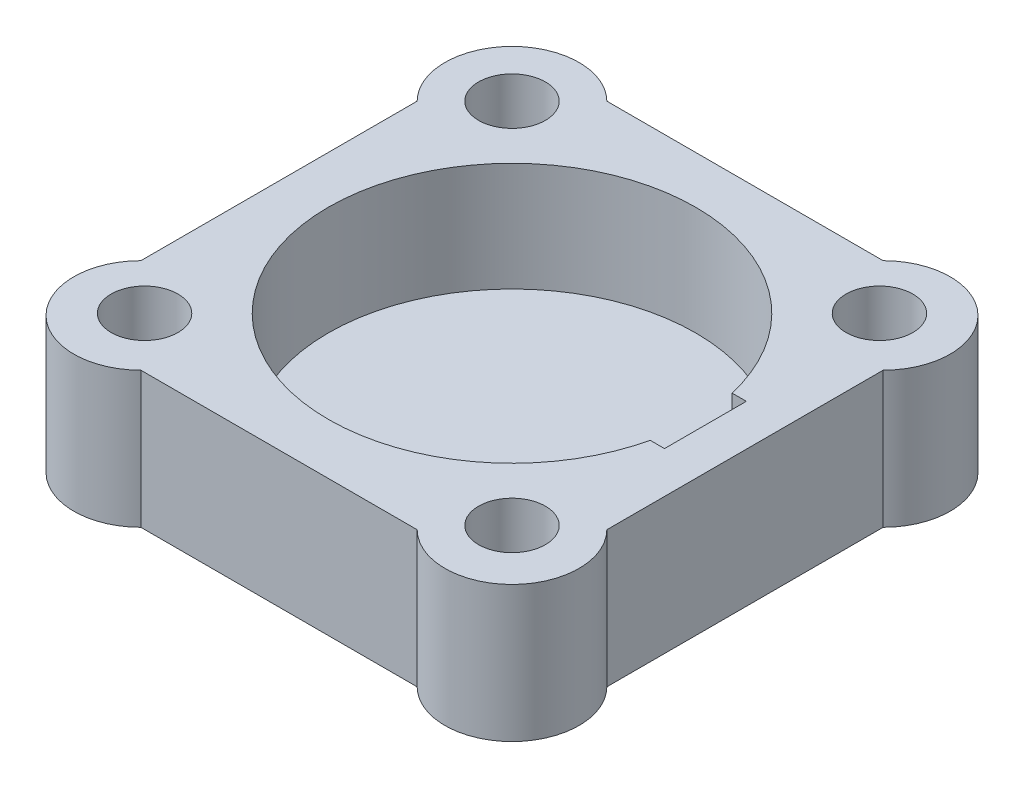
ISO-10303-21;
HEADER;
FILE_DESCRIPTION(('STEP AP214'),'2;1');
FILE_NAME('part.step','',(''),(''),'','','');
FILE_SCHEMA(('AUTOMOTIVE_DESIGN { 1 0 10303 214 1 1 1 1 }'));
ENDSEC;
DATA;
#1=APPLICATION_CONTEXT('core data for automotive mechanical design processes');
#2=APPLICATION_PROTOCOL_DEFINITION('international standard','automotive_design',2000,#1);
#3=PRODUCT_CONTEXT('',#1,'mechanical');
#4=PRODUCT('Part','Part','',(#3));
#5=PRODUCT_RELATED_PRODUCT_CATEGORY('part','',(#4));
#6=PRODUCT_DEFINITION_FORMATION('','',#4);
#7=PRODUCT_DEFINITION_CONTEXT('part definition',#1,'design');
#8=PRODUCT_DEFINITION('design','',#6,#7);
#9=PRODUCT_DEFINITION_SHAPE('','',#8);
#10=(LENGTH_UNIT() NAMED_UNIT(*) SI_UNIT(.MILLI.,.METRE.));
#11=(NAMED_UNIT(*) PLANE_ANGLE_UNIT() SI_UNIT($,.RADIAN.));
#12=(NAMED_UNIT(*) SI_UNIT($,.STERADIAN.) SOLID_ANGLE_UNIT());
#13=UNCERTAINTY_MEASURE_WITH_UNIT(LENGTH_MEASURE(1.E-05),#10,'distance_accuracy_value','');
#14=(GEOMETRIC_REPRESENTATION_CONTEXT(3) GLOBAL_UNCERTAINTY_ASSIGNED_CONTEXT((#13)) GLOBAL_UNIT_ASSIGNED_CONTEXT((#10,
#11,#12)) REPRESENTATION_CONTEXT('',''));
#15=CARTESIAN_POINT('',(0.,0.,0.));
#16=DIRECTION('',(0.,0.,1.));
#17=DIRECTION('',(1.,0.,0.));
#18=AXIS2_PLACEMENT_3D('',#15,#16,#17);
#19=CARTESIAN_POINT('',(0.,15.,0.));
#20=DIRECTION('',(0.,-1.,0.));
#21=DIRECTION('',(0.,0.,-1.));
#22=AXIS2_PLACEMENT_3D('',#19,#20,#21);
#23=CYLINDRICAL_SURFACE('',#22,20.25);
#24=CARTESIAN_POINT('',(0.,15.,0.));
#25=DIRECTION('',(0.,1.,0.));
#26=DIRECTION('',(0.,0.,1.));
#27=AXIS2_PLACEMENT_3D('',#24,#25,#26);
#28=CIRCLE('',#27,20.25);
#29=CARTESIAN_POINT('',(19.7411817978626,15.,-4.510902484397));
#30=VERTEX_POINT('',#29);
#31=CARTESIAN_POINT('',(19.7411817978626,15.,4.510902484397));
#32=VERTEX_POINT('',#31);
#33=EDGE_CURVE('E152',#30,#32,#28,.T.);
#34=ORIENTED_EDGE('',*,*,#33,.T.);
#35=DIRECTION('',(0.,-1.,0.));
#36=VECTOR('',#35,1.);
#37=CARTESIAN_POINT('',(19.7411817978626,15.,4.510902484397));
#38=LINE('',#37,#36);
#39=CARTESIAN_POINT('',(19.7411817978626,3.,4.510902484397));
#40=VERTEX_POINT('',#39);
#41=EDGE_CURVE('E170',#32,#40,#38,.T.);
#42=ORIENTED_EDGE('',*,*,#41,.T.);
#43=CARTESIAN_POINT('',(0.,3.,0.));
#44=DIRECTION('',(0.,-1.,0.));
#45=DIRECTION('',(0.,0.,-1.));
#46=AXIS2_PLACEMENT_3D('',#43,#44,#45);
#47=CIRCLE('',#46,20.25);
#48=CARTESIAN_POINT('',(19.7411817978626,3.,-4.510902484397));
#49=VERTEX_POINT('',#48);
#50=EDGE_CURVE('E173',#40,#49,#47,.T.);
#51=ORIENTED_EDGE('',*,*,#50,.T.);
#52=DIRECTION('',(0.,-1.,0.));
#53=VECTOR('',#52,1.);
#54=CARTESIAN_POINT('',(19.7411817978626,15.,-4.510902484397));
#55=LINE('',#54,#53);
#56=EDGE_CURVE('E55',#30,#49,#55,.T.);
#57=ORIENTED_EDGE('',*,*,#56,.F.);
#58=EDGE_LOOP('',(#34,#42,#51,#57));
#59=FACE_BOUND('',#58,.T.);
#60=ADVANCED_FACE('F33',(#59),#23,.F.);
#61=CARTESIAN_POINT('',(-20.25,15.,-20.25));
#62=DIRECTION('',(0.,-1.,0.));
#63=DIRECTION('',(0.,0.,-1.));
#64=AXIS2_PLACEMENT_3D('',#61,#62,#63);
#65=PLANE('',#64);
#66=CARTESIAN_POINT('',(-20.25,15.,20.25));
#67=DIRECTION('',(0.,1.,0.));
#68=DIRECTION('',(0.,0.,1.));
#69=AXIS2_PLACEMENT_3D('',#66,#67,#68);
#70=CIRCLE('',#69,3.68222971473307);
#71=CARTESIAN_POINT('',(-20.25,15.,23.9322297147331));
#72=VERTEX_POINT('',#71);
#73=EDGE_CURVE('E177',#72,#72,#70,.T.);
#74=ORIENTED_EDGE('',*,*,#73,.F.);
#75=EDGE_LOOP('',(#74));
#76=FACE_BOUND('',#75,.T.);
#77=CARTESIAN_POINT('',(20.25,15.,20.25));
#78=DIRECTION('',(0.,1.,0.));
#79=DIRECTION('',(0.,0.,1.));
#80=AXIS2_PLACEMENT_3D('',#77,#78,#79);
#81=CIRCLE('',#80,3.68222971473307);
#82=CARTESIAN_POINT('',(20.25,15.,23.9322297147331));
#83=VERTEX_POINT('',#82);
#84=EDGE_CURVE('E183',#83,#83,#81,.T.);
#85=ORIENTED_EDGE('',*,*,#84,.F.);
#86=EDGE_LOOP('',(#85));
#87=FACE_BOUND('',#86,.T.);
#88=CARTESIAN_POINT('',(20.25,15.,-20.25));
#89=DIRECTION('',(0.,1.,0.));
#90=DIRECTION('',(0.,0.,1.));
#91=AXIS2_PLACEMENT_3D('',#88,#89,#90);
#92=CIRCLE('',#91,3.68222971473307);
#93=CARTESIAN_POINT('',(20.25,15.,-16.5677702852669));
#94=VERTEX_POINT('',#93);
#95=EDGE_CURVE('E189',#94,#94,#92,.T.);
#96=ORIENTED_EDGE('',*,*,#95,.F.);
#97=EDGE_LOOP('',(#96));
#98=FACE_BOUND('',#97,.T.);
#99=CARTESIAN_POINT('',(-20.25,15.,-20.25));
#100=DIRECTION('',(0.,1.,0.));
#101=DIRECTION('',(0.,0.,1.));
#102=AXIS2_PLACEMENT_3D('',#99,#100,#101);
#103=CIRCLE('',#102,3.68222971473307);
#104=CARTESIAN_POINT('',(-20.25,15.,-16.5677702852669));
#105=VERTEX_POINT('',#104);
#106=EDGE_CURVE('E195',#105,#105,#103,.T.);
#107=ORIENTED_EDGE('',*,*,#106,.F.);
#108=EDGE_LOOP('',(#107));
#109=FACE_BOUND('',#108,.T.);
#110=CARTESIAN_POINT('',(-20.25,15.,-20.25));
#111=DIRECTION('',(0.,1.,0.));
#112=DIRECTION('',(0.,0.,-1.));
#113=AXIS2_PLACEMENT_3D('',#110,#111,#112);
#114=CIRCLE('',#113,7.39252400003237);
#115=CARTESIAN_POINT('',(-15.0226961494928,15.,-25.4773038505072));
#116=VERTEX_POINT('',#115);
#117=CARTESIAN_POINT('',(-25.4773038505072,15.,-15.0226961494928));
#118=VERTEX_POINT('',#117);
#119=EDGE_CURVE('E202',#116,#118,#114,.T.);
#120=ORIENTED_EDGE('',*,*,#119,.T.);
#121=DIRECTION('',(0.,0.,1.));
#122=VECTOR('',#121,1.);
#123=CARTESIAN_POINT('',(-25.4773038505072,15.,15.4331642276718));
#124=LINE('',#123,#122);
#125=CARTESIAN_POINT('',(-25.4773038505072,15.,15.4331642276718));
#126=VERTEX_POINT('',#125);
#127=EDGE_CURVE('E205',#118,#126,#124,.T.);
#128=ORIENTED_EDGE('',*,*,#127,.T.);
#129=CARTESIAN_POINT('',(-20.25,15.,20.660468078179));
#130=DIRECTION('',(0.,1.,0.));
#131=DIRECTION('',(0.,0.,-1.));
#132=AXIS2_PLACEMENT_3D('',#129,#130,#131);
#133=CIRCLE('',#132,7.39252400003237);
#134=CARTESIAN_POINT('',(-15.0226961494928,15.,25.8877719286862));
#135=VERTEX_POINT('',#134);
#136=EDGE_CURVE('E208',#126,#135,#133,.T.);
#137=ORIENTED_EDGE('',*,*,#136,.T.);
#138=DIRECTION('',(1.,0.,0.));
#139=VECTOR('',#138,1.);
#140=CARTESIAN_POINT('',(15.4331642276718,15.,25.8877719286862));
#141=LINE('',#140,#139);
#142=CARTESIAN_POINT('',(15.4331642276718,15.,25.8877719286862));
#143=VERTEX_POINT('',#142);
#144=EDGE_CURVE('E210',#135,#143,#141,.T.);
#145=ORIENTED_EDGE('',*,*,#144,.T.);
#146=CARTESIAN_POINT('',(20.660468078179,15.,20.660468078179));
#147=DIRECTION('',(0.,1.,0.));
#148=DIRECTION('',(0.,0.,-1.));
#149=AXIS2_PLACEMENT_3D('',#146,#147,#148);
#150=CIRCLE('',#149,7.39252400003237);
#151=CARTESIAN_POINT('',(25.8877719286862,15.,15.4331642276718));
#152=VERTEX_POINT('',#151);
#153=EDGE_CURVE('E212',#143,#152,#150,.T.);
#154=ORIENTED_EDGE('',*,*,#153,.T.);
#155=DIRECTION('',(0.,0.,-1.));
#156=VECTOR('',#155,1.);
#157=CARTESIAN_POINT('',(25.8877719286862,15.,-15.0226961494928));
#158=LINE('',#157,#156);
#159=CARTESIAN_POINT('',(25.8877719286862,15.,-15.0226961494928));
#160=VERTEX_POINT('',#159);
#161=EDGE_CURVE('E214',#152,#160,#158,.T.);
#162=ORIENTED_EDGE('',*,*,#161,.T.);
#163=CARTESIAN_POINT('',(20.660468078179,15.,-20.25));
#164=DIRECTION('',(0.,1.,0.));
#165=DIRECTION('',(0.,0.,-1.));
#166=AXIS2_PLACEMENT_3D('',#163,#164,#165);
#167=CIRCLE('',#166,7.39252400003236);
#168=CARTESIAN_POINT('',(15.4331642276718,15.,-25.4773038505072));
#169=VERTEX_POINT('',#168);
#170=EDGE_CURVE('E216',#160,#169,#167,.T.);
#171=ORIENTED_EDGE('',*,*,#170,.T.);
#172=DIRECTION('',(-1.,0.,0.));
#173=VECTOR('',#172,1.);
#174=CARTESIAN_POINT('',(-15.0226961494928,15.,-25.4773038505072));
#175=LINE('',#174,#173);
#176=EDGE_CURVE('E218',#169,#116,#175,.T.);
#177=ORIENTED_EDGE('',*,*,#176,.T.);
#178=EDGE_LOOP('',(#120,#128,#137,#145,#154,#162,#171,#177));
#179=FACE_BOUND('',#178,.T.);
#180=DIRECTION('',(-1.,0.,0.));
#181=VECTOR('',#180,1.);
#182=CARTESIAN_POINT('',(21.3200558487847,15.,4.510902484397));
#183=LINE('',#182,#181);
#184=CARTESIAN_POINT('',(21.3200558487847,15.,4.510902484397));
#185=VERTEX_POINT('',#184);
#186=EDGE_CURVE('E153',#185,#32,#183,.T.);
#187=ORIENTED_EDGE('',*,*,#186,.T.);
#188=ORIENTED_EDGE('',*,*,#33,.F.);
#189=DIRECTION('',(-1.,0.,0.));
#190=VECTOR('',#189,1.);
#191=CARTESIAN_POINT('',(21.3200558487847,15.,-4.510902484397));
#192=LINE('',#191,#190);
#193=CARTESIAN_POINT('',(21.3200558487847,15.,-4.510902484397));
#194=VERTEX_POINT('',#193);
#195=EDGE_CURVE('E134',#194,#30,#192,.T.);
#196=ORIENTED_EDGE('',*,*,#195,.F.);
#197=DIRECTION('',(0.,0.,-1.));
#198=VECTOR('',#197,1.);
#199=CARTESIAN_POINT('',(21.3200558487847,15.,4.510902484397));
#200=LINE('',#199,#198);
#201=EDGE_CURVE('E142',#185,#194,#200,.T.);
#202=ORIENTED_EDGE('',*,*,#201,.F.);
#203=EDGE_LOOP('',(#187,#188,#196,#202));
#204=FACE_BOUND('',#203,.T.);
#205=ADVANCED_FACE('F150',(#76,#87,#98,#109,#179,#204),#65,.F.);
#206=CARTESIAN_POINT('',(-20.25,0.,-20.25));
#207=DIRECTION('',(0.,-1.,0.));
#208=DIRECTION('',(0.,0.,-1.));
#209=AXIS2_PLACEMENT_3D('',#206,#207,#208);
#210=PLANE('',#209);
#211=CARTESIAN_POINT('',(20.25,0.,20.25));
#212=DIRECTION('',(0.,1.,0.));
#213=DIRECTION('',(0.,0.,1.));
#214=AXIS2_PLACEMENT_3D('',#211,#212,#213);
#215=CIRCLE('',#214,3.68222971473307);
#216=CARTESIAN_POINT('',(20.25,0.,23.9322297147331));
#217=VERTEX_POINT('',#216);
#218=EDGE_CURVE('E180',#217,#217,#215,.T.);
#219=ORIENTED_EDGE('',*,*,#218,.T.);
#220=EDGE_LOOP('',(#219));
#221=FACE_BOUND('',#220,.T.);
#222=CARTESIAN_POINT('',(-20.25,0.,-20.25));
#223=DIRECTION('',(0.,1.,0.));
#224=DIRECTION('',(0.,0.,1.));
#225=AXIS2_PLACEMENT_3D('',#222,#223,#224);
#226=CIRCLE('',#225,3.68222971473307);
#227=CARTESIAN_POINT('',(-20.25,0.,-16.5677702852669));
#228=VERTEX_POINT('',#227);
#229=EDGE_CURVE('E192',#228,#228,#226,.T.);
#230=ORIENTED_EDGE('',*,*,#229,.T.);
#231=EDGE_LOOP('',(#230));
#232=FACE_BOUND('',#231,.T.);
#233=CARTESIAN_POINT('',(-20.25,0.,-20.25));
#234=DIRECTION('',(0.,1.,0.));
#235=DIRECTION('',(0.,0.,-1.));
#236=AXIS2_PLACEMENT_3D('',#233,#234,#235);
#237=CIRCLE('',#236,7.39252400003237);
#238=CARTESIAN_POINT('',(-15.0226961494928,0.,-25.4773038505072));
#239=VERTEX_POINT('',#238);
#240=CARTESIAN_POINT('',(-25.4773038505072,0.,-15.0226961494928));
#241=VERTEX_POINT('',#240);
#242=EDGE_CURVE('E201',#239,#241,#237,.T.);
#243=ORIENTED_EDGE('',*,*,#242,.F.);
#244=DIRECTION('',(-1.,0.,0.));
#245=VECTOR('',#244,1.);
#246=CARTESIAN_POINT('',(-15.0226961494928,0.,-25.4773038505072));
#247=LINE('',#246,#245);
#248=CARTESIAN_POINT('',(15.4331642276718,0.,-25.4773038505072));
#249=VERTEX_POINT('',#248);
#250=EDGE_CURVE('E206',#249,#239,#247,.T.);
#251=ORIENTED_EDGE('',*,*,#250,.F.);
#252=CARTESIAN_POINT('',(20.660468078179,0.,-20.25));
#253=DIRECTION('',(0.,1.,0.));
#254=DIRECTION('',(0.,0.,-1.));
#255=AXIS2_PLACEMENT_3D('',#252,#253,#254);
#256=CIRCLE('',#255,7.39252400003236);
#257=CARTESIAN_POINT('',(25.8877719286862,0.,-15.0226961494928));
#258=VERTEX_POINT('',#257);
#259=EDGE_CURVE('E233',#258,#249,#256,.T.);
#260=ORIENTED_EDGE('',*,*,#259,.F.);
#261=DIRECTION('',(0.,0.,-1.));
#262=VECTOR('',#261,1.);
#263=CARTESIAN_POINT('',(25.8877719286862,0.,-15.0226961494928));
#264=LINE('',#263,#262);
#265=CARTESIAN_POINT('',(25.8877719286862,0.,15.4331642276718));
#266=VERTEX_POINT('',#265);
#267=EDGE_CURVE('E231',#266,#258,#264,.T.);
#268=ORIENTED_EDGE('',*,*,#267,.F.);
#269=CARTESIAN_POINT('',(20.660468078179,0.,20.660468078179));
#270=DIRECTION('',(0.,1.,0.));
#271=DIRECTION('',(0.,0.,-1.));
#272=AXIS2_PLACEMENT_3D('',#269,#270,#271);
#273=CIRCLE('',#272,7.39252400003237);
#274=CARTESIAN_POINT('',(15.4331642276718,0.,25.8877719286862));
#275=VERTEX_POINT('',#274);
#276=EDGE_CURVE('E229',#275,#266,#273,.T.);
#277=ORIENTED_EDGE('',*,*,#276,.F.);
#278=DIRECTION('',(1.,0.,0.));
#279=VECTOR('',#278,1.);
#280=CARTESIAN_POINT('',(15.4331642276718,0.,25.8877719286862));
#281=LINE('',#280,#279);
#282=CARTESIAN_POINT('',(-15.0226961494928,0.,25.8877719286862));
#283=VERTEX_POINT('',#282);
#284=EDGE_CURVE('E227',#283,#275,#281,.T.);
#285=ORIENTED_EDGE('',*,*,#284,.F.);
#286=CARTESIAN_POINT('',(-20.25,0.,20.660468078179));
#287=DIRECTION('',(0.,1.,0.));
#288=DIRECTION('',(0.,0.,-1.));
#289=AXIS2_PLACEMENT_3D('',#286,#287,#288);
#290=CIRCLE('',#289,7.39252400003237);
#291=CARTESIAN_POINT('',(-25.4773038505072,0.,15.4331642276718));
#292=VERTEX_POINT('',#291);
#293=EDGE_CURVE('E225',#292,#283,#290,.T.);
#294=ORIENTED_EDGE('',*,*,#293,.F.);
#295=DIRECTION('',(0.,0.,1.));
#296=VECTOR('',#295,1.);
#297=CARTESIAN_POINT('',(-25.4773038505072,0.,15.4331642276718));
#298=LINE('',#297,#296);
#299=EDGE_CURVE('E223',#241,#292,#298,.T.);
#300=ORIENTED_EDGE('',*,*,#299,.F.);
#301=EDGE_LOOP('',(#243,#251,#260,#268,#277,#285,#294,#300));
#302=FACE_BOUND('',#301,.T.);
#303=CARTESIAN_POINT('',(20.25,0.,-20.25));
#304=DIRECTION('',(0.,1.,0.));
#305=DIRECTION('',(0.,0.,1.));
#306=AXIS2_PLACEMENT_3D('',#303,#304,#305);
#307=CIRCLE('',#306,3.68222971473307);
#308=CARTESIAN_POINT('',(20.25,0.,-16.5677702852669));
#309=VERTEX_POINT('',#308);
#310=EDGE_CURVE('E186',#309,#309,#307,.T.);
#311=ORIENTED_EDGE('',*,*,#310,.T.);
#312=EDGE_LOOP('',(#311));
#313=FACE_BOUND('',#312,.T.);
#314=CARTESIAN_POINT('',(-20.25,0.,20.25));
#315=DIRECTION('',(0.,1.,0.));
#316=DIRECTION('',(0.,0.,1.));
#317=AXIS2_PLACEMENT_3D('',#314,#315,#316);
#318=CIRCLE('',#317,3.68222971473307);
#319=CARTESIAN_POINT('',(-20.25,0.,23.9322297147331));
#320=VERTEX_POINT('',#319);
#321=EDGE_CURVE('E176',#320,#320,#318,.T.);
#322=ORIENTED_EDGE('',*,*,#321,.T.);
#323=EDGE_LOOP('',(#322));
#324=FACE_BOUND('',#323,.T.);
#325=DIRECTION('',(0.,0.,-1.));
#326=VECTOR('',#325,1.);
#327=CARTESIAN_POINT('',(19.1799441512153,0.,4.510902484397));
#328=LINE('',#327,#326);
#329=CARTESIAN_POINT('',(19.1799441512153,0.,4.510902484397));
#330=VERTEX_POINT('',#329);
#331=CARTESIAN_POINT('',(19.1799441512153,0.,-4.510902484397));
#332=VERTEX_POINT('',#331);
#333=EDGE_CURVE('E158',#330,#332,#328,.T.);
#334=ORIENTED_EDGE('',*,*,#333,.F.);
#335=DIRECTION('',(-1.,0.,0.));
#336=VECTOR('',#335,1.);
#337=CARTESIAN_POINT('',(21.3200558487847,0.,4.510902484397));
#338=LINE('',#337,#336);
#339=CARTESIAN_POINT('',(21.3200558487847,0.,4.510902484397));
#340=VERTEX_POINT('',#339);
#341=EDGE_CURVE('E147',#340,#330,#338,.T.);
#342=ORIENTED_EDGE('',*,*,#341,.F.);
#343=DIRECTION('',(0.,0.,-1.));
#344=VECTOR('',#343,1.);
#345=CARTESIAN_POINT('',(21.3200558487847,0.,4.510902484397));
#346=LINE('',#345,#344);
#347=CARTESIAN_POINT('',(21.3200558487847,0.,-4.510902484397));
#348=VERTEX_POINT('',#347);
#349=EDGE_CURVE('E161',#340,#348,#346,.T.);
#350=ORIENTED_EDGE('',*,*,#349,.T.);
#351=DIRECTION('',(-1.,0.,0.));
#352=VECTOR('',#351,1.);
#353=CARTESIAN_POINT('',(21.3200558487847,0.,-4.510902484397));
#354=LINE('',#353,#352);
#355=EDGE_CURVE('E48',#348,#332,#354,.T.);
#356=ORIENTED_EDGE('',*,*,#355,.T.);
#357=EDGE_LOOP('',(#334,#342,#350,#356));
#358=FACE_BOUND('',#357,.T.);
#359=ADVANCED_FACE('F274',(#221,#232,#302,#313,#324,#358),#210,.T.);
#360=CARTESIAN_POINT('',(0.,3.,0.));
#361=DIRECTION('',(0.,-1.,0.));
#362=DIRECTION('',(0.,0.,-1.));
#363=AXIS2_PLACEMENT_3D('',#360,#361,#362);
#364=PLANE('',#363);
#365=DIRECTION('',(1.,0.,0.));
#366=VECTOR('',#365,1.);
#367=CARTESIAN_POINT('',(0.,3.,4.510902484397));
#368=LINE('',#367,#366);
#369=CARTESIAN_POINT('',(19.1799441512153,3.,4.510902484397));
#370=VERTEX_POINT('',#369);
#371=EDGE_CURVE('E11',#370,#40,#368,.T.);
#372=ORIENTED_EDGE('',*,*,#371,.F.);
#373=DIRECTION('',(0.,0.,1.));
#374=VECTOR('',#373,1.);
#375=CARTESIAN_POINT('',(19.1799441512153,3.,0.));
#376=LINE('',#375,#374);
#377=CARTESIAN_POINT('',(19.1799441512153,3.,-4.510902484397));
#378=VERTEX_POINT('',#377);
#379=EDGE_CURVE('E41',#378,#370,#376,.T.);
#380=ORIENTED_EDGE('',*,*,#379,.F.);
#381=DIRECTION('',(1.,0.,0.));
#382=VECTOR('',#381,1.);
#383=CARTESIAN_POINT('',(0.,3.,-4.510902484397));
#384=LINE('',#383,#382);
#385=EDGE_CURVE('E259',#378,#49,#384,.T.);
#386=ORIENTED_EDGE('',*,*,#385,.T.);
#387=ORIENTED_EDGE('',*,*,#50,.F.);
#388=EDGE_LOOP('',(#372,#380,#386,#387));
#389=FACE_BOUND('',#388,.T.);
#390=ADVANCED_FACE('F271',(#389),#364,.F.);
#391=CARTESIAN_POINT('',(-20.25,15.,-20.25));
#392=DIRECTION('',(0.,-1.,0.));
#393=DIRECTION('',(0.,0.,-1.));
#394=AXIS2_PLACEMENT_3D('',#391,#392,#393);
#395=CYLINDRICAL_SURFACE('',#394,7.39252400003237);
#396=ORIENTED_EDGE('',*,*,#242,.T.);
#397=DIRECTION('',(0.,-1.,0.));
#398=VECTOR('',#397,1.);
#399=CARTESIAN_POINT('',(-25.4773038505072,15.,-15.0226961494928));
#400=LINE('',#399,#398);
#401=EDGE_CURVE('E256',#118,#241,#400,.T.);
#402=ORIENTED_EDGE('',*,*,#401,.F.);
#403=ORIENTED_EDGE('',*,*,#119,.F.);
#404=DIRECTION('',(0.,-1.,0.));
#405=VECTOR('',#404,1.);
#406=CARTESIAN_POINT('',(-15.0226961494928,15.,-25.4773038505072));
#407=LINE('',#406,#405);
#408=EDGE_CURVE('E220',#116,#239,#407,.T.);
#409=ORIENTED_EDGE('',*,*,#408,.T.);
#410=EDGE_LOOP('',(#396,#402,#403,#409));
#411=FACE_BOUND('',#410,.T.);
#412=ADVANCED_FACE('F35',(#411),#395,.T.);
#413=CARTESIAN_POINT('',(-25.4773038505072,15.,15.4331642276718));
#414=DIRECTION('',(1.,0.,0.));
#415=DIRECTION('',(0.,0.,-1.));
#416=AXIS2_PLACEMENT_3D('',#413,#414,#415);
#417=PLANE('',#416);
#418=ORIENTED_EDGE('',*,*,#299,.T.);
#419=DIRECTION('',(0.,-1.,0.));
#420=VECTOR('',#419,1.);
#421=CARTESIAN_POINT('',(-25.4773038505072,15.,15.4331642276718));
#422=LINE('',#421,#420);
#423=EDGE_CURVE('E253',#126,#292,#422,.T.);
#424=ORIENTED_EDGE('',*,*,#423,.F.);
#425=ORIENTED_EDGE('',*,*,#127,.F.);
#426=ORIENTED_EDGE('',*,*,#401,.T.);
#427=EDGE_LOOP('',(#418,#424,#425,#426));
#428=FACE_BOUND('',#427,.T.);
#429=ADVANCED_FACE('F392',(#428),#417,.F.);
#430=CARTESIAN_POINT('',(-20.25,15.,20.660468078179));
#431=DIRECTION('',(0.,-1.,0.));
#432=DIRECTION('',(0.,0.,-1.));
#433=AXIS2_PLACEMENT_3D('',#430,#431,#432);
#434=CYLINDRICAL_SURFACE('',#433,7.39252400003237);
#435=ORIENTED_EDGE('',*,*,#293,.T.);
#436=DIRECTION('',(0.,-1.,0.));
#437=VECTOR('',#436,1.);
#438=CARTESIAN_POINT('',(-15.0226961494928,15.,25.8877719286862));
#439=LINE('',#438,#437);
#440=EDGE_CURVE('E250',#135,#283,#439,.T.);
#441=ORIENTED_EDGE('',*,*,#440,.F.);
#442=ORIENTED_EDGE('',*,*,#136,.F.);
#443=ORIENTED_EDGE('',*,*,#423,.T.);
#444=EDGE_LOOP('',(#435,#441,#442,#443));
#445=FACE_BOUND('',#444,.T.);
#446=ADVANCED_FACE('F384',(#445),#434,.T.);
#447=CARTESIAN_POINT('',(15.4331642276718,15.,25.8877719286862));
#448=DIRECTION('',(0.,0.,-1.));
#449=DIRECTION('',(-1.,0.,0.));
#450=AXIS2_PLACEMENT_3D('',#447,#448,#449);
#451=PLANE('',#450);
#452=ORIENTED_EDGE('',*,*,#284,.T.);
#453=DIRECTION('',(0.,-1.,0.));
#454=VECTOR('',#453,1.);
#455=CARTESIAN_POINT('',(15.4331642276718,15.,25.8877719286862));
#456=LINE('',#455,#454);
#457=EDGE_CURVE('E247',#143,#275,#456,.T.);
#458=ORIENTED_EDGE('',*,*,#457,.F.);
#459=ORIENTED_EDGE('',*,*,#144,.F.);
#460=ORIENTED_EDGE('',*,*,#440,.T.);
#461=EDGE_LOOP('',(#452,#458,#459,#460));
#462=FACE_BOUND('',#461,.T.);
#463=ADVANCED_FACE('F376',(#462),#451,.F.);
#464=CARTESIAN_POINT('',(20.660468078179,15.,20.660468078179));
#465=DIRECTION('',(0.,-1.,0.));
#466=DIRECTION('',(0.,0.,-1.));
#467=AXIS2_PLACEMENT_3D('',#464,#465,#466);
#468=CYLINDRICAL_SURFACE('',#467,7.39252400003237);
#469=ORIENTED_EDGE('',*,*,#276,.T.);
#470=DIRECTION('',(0.,-1.,0.));
#471=VECTOR('',#470,1.);
#472=CARTESIAN_POINT('',(25.8877719286862,15.,15.4331642276718));
#473=LINE('',#472,#471);
#474=EDGE_CURVE('E244',#152,#266,#473,.T.);
#475=ORIENTED_EDGE('',*,*,#474,.F.);
#476=ORIENTED_EDGE('',*,*,#153,.F.);
#477=ORIENTED_EDGE('',*,*,#457,.T.);
#478=EDGE_LOOP('',(#469,#475,#476,#477));
#479=FACE_BOUND('',#478,.T.);
#480=ADVANCED_FACE('F368',(#479),#468,.T.);
#481=CARTESIAN_POINT('',(25.8877719286862,15.,-15.0226961494928));
#482=DIRECTION('',(-1.,0.,0.));
#483=DIRECTION('',(0.,0.,1.));
#484=AXIS2_PLACEMENT_3D('',#481,#482,#483);
#485=PLANE('',#484);
#486=ORIENTED_EDGE('',*,*,#267,.T.);
#487=DIRECTION('',(0.,-1.,0.));
#488=VECTOR('',#487,1.);
#489=CARTESIAN_POINT('',(25.8877719286862,15.,-15.0226961494928));
#490=LINE('',#489,#488);
#491=EDGE_CURVE('E241',#160,#258,#490,.T.);
#492=ORIENTED_EDGE('',*,*,#491,.F.);
#493=ORIENTED_EDGE('',*,*,#161,.F.);
#494=ORIENTED_EDGE('',*,*,#474,.T.);
#495=EDGE_LOOP('',(#486,#492,#493,#494));
#496=FACE_BOUND('',#495,.T.);
#497=ADVANCED_FACE('F360',(#496),#485,.F.);
#498=CARTESIAN_POINT('',(20.660468078179,15.,-20.25));
#499=DIRECTION('',(0.,-1.,0.));
#500=DIRECTION('',(0.,0.,-1.));
#501=AXIS2_PLACEMENT_3D('',#498,#499,#500);
#502=CYLINDRICAL_SURFACE('',#501,7.39252400003236);
#503=ORIENTED_EDGE('',*,*,#259,.T.);
#504=DIRECTION('',(0.,-1.,0.));
#505=VECTOR('',#504,1.);
#506=CARTESIAN_POINT('',(15.4331642276718,15.,-25.4773038505072));
#507=LINE('',#506,#505);
#508=EDGE_CURVE('E238',#169,#249,#507,.T.);
#509=ORIENTED_EDGE('',*,*,#508,.F.);
#510=ORIENTED_EDGE('',*,*,#170,.F.);
#511=ORIENTED_EDGE('',*,*,#491,.T.);
#512=EDGE_LOOP('',(#503,#509,#510,#511));
#513=FACE_BOUND('',#512,.T.);
#514=ADVANCED_FACE('F353',(#513),#502,.T.);
#515=CARTESIAN_POINT('',(-15.0226961494928,15.,-25.4773038505072));
#516=DIRECTION('',(0.,0.,1.));
#517=DIRECTION('',(1.,0.,0.));
#518=AXIS2_PLACEMENT_3D('',#515,#516,#517);
#519=PLANE('',#518);
#520=ORIENTED_EDGE('',*,*,#250,.T.);
#521=ORIENTED_EDGE('',*,*,#408,.F.);
#522=ORIENTED_EDGE('',*,*,#176,.F.);
#523=ORIENTED_EDGE('',*,*,#508,.T.);
#524=EDGE_LOOP('',(#520,#521,#522,#523));
#525=FACE_BOUND('',#524,.T.);
#526=ADVANCED_FACE('F296',(#525),#519,.F.);
#527=CARTESIAN_POINT('',(-20.25,15.,-20.25));
#528=DIRECTION('',(0.,-1.,0.));
#529=DIRECTION('',(0.,0.,-1.));
#530=AXIS2_PLACEMENT_3D('',#527,#528,#529);
#531=CYLINDRICAL_SURFACE('',#530,3.68222971473307);
#532=ORIENTED_EDGE('',*,*,#106,.T.);
#533=EDGE_LOOP('',(#532));
#534=FACE_BOUND('',#533,.T.);
#535=ORIENTED_EDGE('',*,*,#229,.F.);
#536=EDGE_LOOP('',(#535));
#537=FACE_BOUND('',#536,.T.);
#538=ADVANCED_FACE('F292',(#534,#537),#531,.F.);
#539=CARTESIAN_POINT('',(20.25,15.,-20.25));
#540=DIRECTION('',(0.,-1.,0.));
#541=DIRECTION('',(0.,0.,-1.));
#542=AXIS2_PLACEMENT_3D('',#539,#540,#541);
#543=CYLINDRICAL_SURFACE('',#542,3.68222971473307);
#544=ORIENTED_EDGE('',*,*,#95,.T.);
#545=EDGE_LOOP('',(#544));
#546=FACE_BOUND('',#545,.T.);
#547=ORIENTED_EDGE('',*,*,#310,.F.);
#548=EDGE_LOOP('',(#547));
#549=FACE_BOUND('',#548,.T.);
#550=ADVANCED_FACE('F295',(#546,#549),#543,.F.);
#551=CARTESIAN_POINT('',(20.25,15.,20.25));
#552=DIRECTION('',(0.,-1.,0.));
#553=DIRECTION('',(0.,0.,-1.));
#554=AXIS2_PLACEMENT_3D('',#551,#552,#553);
#555=CYLINDRICAL_SURFACE('',#554,3.68222971473307);
#556=ORIENTED_EDGE('',*,*,#84,.T.);
#557=EDGE_LOOP('',(#556));
#558=FACE_BOUND('',#557,.T.);
#559=ORIENTED_EDGE('',*,*,#218,.F.);
#560=EDGE_LOOP('',(#559));
#561=FACE_BOUND('',#560,.T.);
#562=ADVANCED_FACE('F300',(#558,#561),#555,.F.);
#563=CARTESIAN_POINT('',(-20.25,15.,20.25));
#564=DIRECTION('',(0.,-1.,0.));
#565=DIRECTION('',(0.,0.,-1.));
#566=AXIS2_PLACEMENT_3D('',#563,#564,#565);
#567=CYLINDRICAL_SURFACE('',#566,3.68222971473307);
#568=ORIENTED_EDGE('',*,*,#73,.T.);
#569=EDGE_LOOP('',(#568));
#570=FACE_BOUND('',#569,.T.);
#571=ORIENTED_EDGE('',*,*,#321,.F.);
#572=EDGE_LOOP('',(#571));
#573=FACE_BOUND('',#572,.T.);
#574=ADVANCED_FACE('F304',(#570,#573),#567,.F.);
#575=CARTESIAN_POINT('',(19.1799441512153,0.,4.510902484397));
#576=DIRECTION('',(1.,0.,0.));
#577=DIRECTION('',(0.,0.,-1.));
#578=AXIS2_PLACEMENT_3D('',#575,#576,#577);
#579=PLANE('',#578);
#580=ORIENTED_EDGE('',*,*,#379,.T.);
#581=DIRECTION('',(0.,1.,0.));
#582=VECTOR('',#581,1.);
#583=CARTESIAN_POINT('',(19.1799441512153,0.,4.510902484397));
#584=LINE('',#583,#582);
#585=EDGE_CURVE('E166',#330,#370,#584,.T.);
#586=ORIENTED_EDGE('',*,*,#585,.F.);
#587=ORIENTED_EDGE('',*,*,#333,.T.);
#588=DIRECTION('',(0.,1.,0.));
#589=VECTOR('',#588,1.);
#590=CARTESIAN_POINT('',(19.1799441512153,0.,-4.510902484397));
#591=LINE('',#590,#589);
#592=EDGE_CURVE('E138',#332,#378,#591,.T.);
#593=ORIENTED_EDGE('',*,*,#592,.T.);
#594=EDGE_LOOP('',(#580,#586,#587,#593));
#595=FACE_BOUND('',#594,.T.);
#596=ADVANCED_FACE('F263',(#595),#579,.T.);
#597=CARTESIAN_POINT('',(21.3200558487847,0.,4.510902484397));
#598=DIRECTION('',(0.,0.,-1.));
#599=DIRECTION('',(-1.,0.,0.));
#600=AXIS2_PLACEMENT_3D('',#597,#598,#599);
#601=PLANE('',#600);
#602=ORIENTED_EDGE('',*,*,#186,.F.);
#603=DIRECTION('',(0.,1.,0.));
#604=VECTOR('',#603,1.);
#605=CARTESIAN_POINT('',(21.3200558487847,0.,4.510902484397));
#606=LINE('',#605,#604);
#607=EDGE_CURVE('E139',#340,#185,#606,.T.);
#608=ORIENTED_EDGE('',*,*,#607,.F.);
#609=ORIENTED_EDGE('',*,*,#341,.T.);
#610=ORIENTED_EDGE('',*,*,#585,.T.);
#611=ORIENTED_EDGE('',*,*,#371,.T.);
#612=ORIENTED_EDGE('',*,*,#41,.F.);
#613=EDGE_LOOP('',(#602,#608,#609,#610,#611,#612));
#614=FACE_BOUND('',#613,.T.);
#615=ADVANCED_FACE('F268',(#614),#601,.T.);
#616=CARTESIAN_POINT('',(21.3200558487847,0.,-4.510902484397));
#617=DIRECTION('',(0.,0.,-1.));
#618=DIRECTION('',(-1.,0.,0.));
#619=AXIS2_PLACEMENT_3D('',#616,#617,#618);
#620=PLANE('',#619);
#621=ORIENTED_EDGE('',*,*,#56,.T.);
#622=ORIENTED_EDGE('',*,*,#385,.F.);
#623=ORIENTED_EDGE('',*,*,#592,.F.);
#624=ORIENTED_EDGE('',*,*,#355,.F.);
#625=DIRECTION('',(0.,1.,0.));
#626=VECTOR('',#625,1.);
#627=CARTESIAN_POINT('',(21.3200558487847,0.,-4.510902484397));
#628=LINE('',#627,#626);
#629=EDGE_CURVE('E130',#348,#194,#628,.T.);
#630=ORIENTED_EDGE('',*,*,#629,.T.);
#631=ORIENTED_EDGE('',*,*,#195,.T.);
#632=EDGE_LOOP('',(#621,#622,#623,#624,#630,#631));
#633=FACE_BOUND('',#632,.T.);
#634=ADVANCED_FACE('F132',(#633),#620,.F.);
#635=CARTESIAN_POINT('',(21.3200558487847,0.,4.510902484397));
#636=DIRECTION('',(1.,0.,0.));
#637=DIRECTION('',(0.,0.,-1.));
#638=AXIS2_PLACEMENT_3D('',#635,#636,#637);
#639=PLANE('',#638);
#640=ORIENTED_EDGE('',*,*,#629,.F.);
#641=ORIENTED_EDGE('',*,*,#349,.F.);
#642=ORIENTED_EDGE('',*,*,#607,.T.);
#643=ORIENTED_EDGE('',*,*,#201,.T.);
#644=EDGE_LOOP('',(#640,#641,#642,#643));
#645=FACE_BOUND('',#644,.T.);
#646=ADVANCED_FACE('F143',(#645),#639,.F.);
#647=CLOSED_SHELL('',(#60,#205,#359,#390,#412,#429,#446,#463,#480,#497,#514,#526,#538,#550,#562,
#574,#596,#615,#634,#646));
#648=MANIFOLD_SOLID_BREP('B2',#647);
#649=ADVANCED_BREP_SHAPE_REPRESENTATION('',(#18,#648),#14);
#650=SHAPE_DEFINITION_REPRESENTATION(#9,#649);
ENDSEC;
END-ISO-10303-21;
